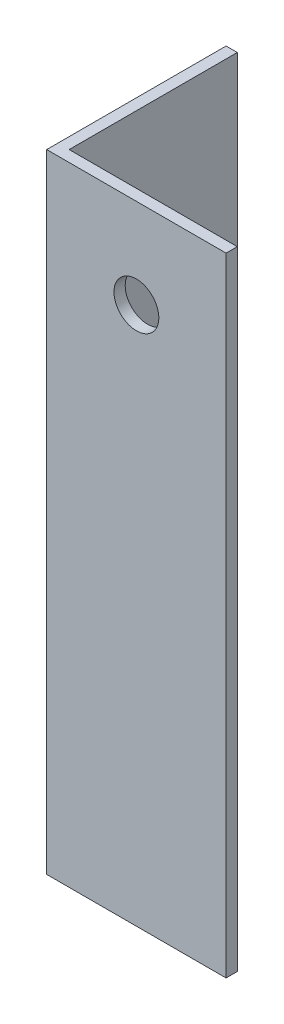
ISO-10303-21;
HEADER;
FILE_DESCRIPTION(('STEP AP214'),'2;1');
FILE_NAME('part.step','',(''),(''),'','','');
FILE_SCHEMA(('AUTOMOTIVE_DESIGN { 1 0 10303 214 1 1 1 1 }'));
ENDSEC;
DATA;
#1=APPLICATION_CONTEXT('core data for automotive mechanical design processes');
#2=APPLICATION_PROTOCOL_DEFINITION('international standard','automotive_design',2000,#1);
#3=PRODUCT_CONTEXT('',#1,'mechanical');
#4=PRODUCT('Part','Part','',(#3));
#5=PRODUCT_RELATED_PRODUCT_CATEGORY('part','',(#4));
#6=PRODUCT_DEFINITION_FORMATION('','',#4);
#7=PRODUCT_DEFINITION_CONTEXT('part definition',#1,'design');
#8=PRODUCT_DEFINITION('design','',#6,#7);
#9=PRODUCT_DEFINITION_SHAPE('','',#8);
#10=(LENGTH_UNIT() NAMED_UNIT(*) SI_UNIT(.MILLI.,.METRE.));
#11=(NAMED_UNIT(*) PLANE_ANGLE_UNIT() SI_UNIT($,.RADIAN.));
#12=(NAMED_UNIT(*) SI_UNIT($,.STERADIAN.) SOLID_ANGLE_UNIT());
#13=UNCERTAINTY_MEASURE_WITH_UNIT(LENGTH_MEASURE(1.E-05),#10,'distance_accuracy_value','');
#14=(GEOMETRIC_REPRESENTATION_CONTEXT(3) GLOBAL_UNCERTAINTY_ASSIGNED_CONTEXT((#13)) GLOBAL_UNIT_ASSIGNED_CONTEXT((#10,
#11,#12)) REPRESENTATION_CONTEXT('',''));
#15=CARTESIAN_POINT('',(0.,0.,0.));
#16=DIRECTION('',(0.,0.,1.));
#17=DIRECTION('',(1.,0.,0.));
#18=AXIS2_PLACEMENT_3D('',#15,#16,#17);
#19=CARTESIAN_POINT('',(25.4,88.9,0.));
#20=DIRECTION('',(0.,0.,-1.));
#21=DIRECTION('',(-1.,0.,0.));
#22=AXIS2_PLACEMENT_3D('',#19,#20,#21);
#23=PLANE('',#22);
#24=CARTESIAN_POINT('',(12.7,76.2,0.));
#25=DIRECTION('',(0.,0.,-1.));
#26=DIRECTION('',(-1.,0.,0.));
#27=AXIS2_PLACEMENT_3D('',#24,#25,#26);
#28=CIRCLE('',#27,3.175);
#29=CARTESIAN_POINT('',(9.525,76.2,0.));
#30=VERTEX_POINT('',#29);
#31=EDGE_CURVE('E163',#30,#30,#28,.T.);
#32=ORIENTED_EDGE('',*,*,#31,.T.);
#33=EDGE_LOOP('',(#32));
#34=FACE_BOUND('',#33,.T.);
#35=DIRECTION('',(1.,0.,0.));
#36=VECTOR('',#35,1.);
#37=CARTESIAN_POINT('',(25.4,0.,0.));
#38=LINE('',#37,#36);
#39=CARTESIAN_POINT('',(0.,0.,0.));
#40=VERTEX_POINT('',#39);
#41=CARTESIAN_POINT('',(25.4,0.,0.));
#42=VERTEX_POINT('',#41);
#43=EDGE_CURVE('E118',#40,#42,#38,.T.);
#44=ORIENTED_EDGE('',*,*,#43,.T.);
#45=DIRECTION('',(0.,-1.,0.));
#46=VECTOR('',#45,1.);
#47=CARTESIAN_POINT('',(25.4,88.9,0.));
#48=LINE('',#47,#46);
#49=CARTESIAN_POINT('',(25.4,88.9,0.));
#50=VERTEX_POINT('',#49);
#51=EDGE_CURVE('E11',#50,#42,#48,.T.);
#52=ORIENTED_EDGE('',*,*,#51,.F.);
#53=DIRECTION('',(1.,0.,0.));
#54=VECTOR('',#53,1.);
#55=CARTESIAN_POINT('',(25.4,88.9,0.));
#56=LINE('',#55,#54);
#57=CARTESIAN_POINT('',(0.,88.9,0.));
#58=VERTEX_POINT('',#57);
#59=EDGE_CURVE('E129',#58,#50,#56,.T.);
#60=ORIENTED_EDGE('',*,*,#59,.F.);
#61=DIRECTION('',(0.,-1.,0.));
#62=VECTOR('',#61,1.);
#63=CARTESIAN_POINT('',(0.,88.9,0.));
#64=LINE('',#63,#62);
#65=EDGE_CURVE('E114',#58,#40,#64,.T.);
#66=ORIENTED_EDGE('',*,*,#65,.T.);
#67=EDGE_LOOP('',(#44,#52,#60,#66));
#68=FACE_BOUND('',#67,.T.);
#69=ADVANCED_FACE('F34',(#34,#68),#23,.F.);
#70=CARTESIAN_POINT('',(25.4,88.9,-1.5875));
#71=DIRECTION('',(-1.,0.,0.));
#72=DIRECTION('',(0.,0.,1.));
#73=AXIS2_PLACEMENT_3D('',#70,#71,#72);
#74=PLANE('',#73);
#75=DIRECTION('',(0.,0.,-1.));
#76=VECTOR('',#75,1.);
#77=CARTESIAN_POINT('',(25.4,0.,-1.5875));
#78=LINE('',#77,#76);
#79=CARTESIAN_POINT('',(25.4,0.,-1.5875));
#80=VERTEX_POINT('',#79);
#81=EDGE_CURVE('E121',#42,#80,#78,.T.);
#82=ORIENTED_EDGE('',*,*,#81,.T.);
#83=DIRECTION('',(0.,-1.,0.));
#84=VECTOR('',#83,1.);
#85=CARTESIAN_POINT('',(25.4,88.9,-1.5875));
#86=LINE('',#85,#84);
#87=CARTESIAN_POINT('',(25.4,88.9,-1.5875));
#88=VERTEX_POINT('',#87);
#89=EDGE_CURVE('E42',#88,#80,#86,.T.);
#90=ORIENTED_EDGE('',*,*,#89,.F.);
#91=DIRECTION('',(0.,0.,-1.));
#92=VECTOR('',#91,1.);
#93=CARTESIAN_POINT('',(25.4,88.9,-1.5875));
#94=LINE('',#93,#92);
#95=EDGE_CURVE('E87',#50,#88,#94,.T.);
#96=ORIENTED_EDGE('',*,*,#95,.F.);
#97=ORIENTED_EDGE('',*,*,#51,.T.);
#98=EDGE_LOOP('',(#82,#90,#96,#97));
#99=FACE_BOUND('',#98,.T.);
#100=ADVANCED_FACE('F156',(#99),#74,.F.);
#101=CARTESIAN_POINT('',(1.5875,88.9,-1.5875));
#102=DIRECTION('',(0.,0.,1.));
#103=DIRECTION('',(1.,0.,0.));
#104=AXIS2_PLACEMENT_3D('',#101,#102,#103);
#105=PLANE('',#104);
#106=CARTESIAN_POINT('',(12.7,76.2,-1.5875));
#107=DIRECTION('',(0.,0.,-1.));
#108=DIRECTION('',(-1.,0.,0.));
#109=AXIS2_PLACEMENT_3D('',#106,#107,#108);
#110=CIRCLE('',#109,3.175);
#111=CARTESIAN_POINT('',(9.525,76.2,-1.5875));
#112=VERTEX_POINT('',#111);
#113=EDGE_CURVE('E166',#112,#112,#110,.T.);
#114=ORIENTED_EDGE('',*,*,#113,.F.);
#115=EDGE_LOOP('',(#114));
#116=FACE_BOUND('',#115,.T.);
#117=DIRECTION('',(-1.,0.,0.));
#118=VECTOR('',#117,1.);
#119=CARTESIAN_POINT('',(1.5875,0.,-1.5875));
#120=LINE('',#119,#118);
#121=CARTESIAN_POINT('',(1.5875,0.,-1.5875));
#122=VERTEX_POINT('',#121);
#123=EDGE_CURVE('E124',#80,#122,#120,.T.);
#124=ORIENTED_EDGE('',*,*,#123,.T.);
#125=DIRECTION('',(0.,-1.,0.));
#126=VECTOR('',#125,1.);
#127=CARTESIAN_POINT('',(1.5875,88.9,-1.5875));
#128=LINE('',#127,#126);
#129=CARTESIAN_POINT('',(1.5875,88.9,-1.5875));
#130=VERTEX_POINT('',#129);
#131=EDGE_CURVE('E109',#130,#122,#128,.T.);
#132=ORIENTED_EDGE('',*,*,#131,.F.);
#133=DIRECTION('',(-1.,0.,0.));
#134=VECTOR('',#133,1.);
#135=CARTESIAN_POINT('',(1.5875,88.9,-1.5875));
#136=LINE('',#135,#134);
#137=EDGE_CURVE('E100',#88,#130,#136,.T.);
#138=ORIENTED_EDGE('',*,*,#137,.F.);
#139=ORIENTED_EDGE('',*,*,#89,.T.);
#140=EDGE_LOOP('',(#124,#132,#138,#139));
#141=FACE_BOUND('',#140,.T.);
#142=ADVANCED_FACE('F135',(#116,#141),#105,.F.);
#143=CARTESIAN_POINT('',(1.5875,88.9,-25.4));
#144=DIRECTION('',(-1.,0.,0.));
#145=DIRECTION('',(0.,0.,1.));
#146=AXIS2_PLACEMENT_3D('',#143,#144,#145);
#147=PLANE('',#146);
#148=CARTESIAN_POINT('',(1.58750000000001,12.7,-12.7));
#149=DIRECTION('',(-1.,0.,0.));
#150=DIRECTION('',(0.,0.,1.));
#151=AXIS2_PLACEMENT_3D('',#148,#149,#150);
#152=CIRCLE('',#151,2.54);
#153=CARTESIAN_POINT('',(1.58750000000001,12.7,-10.16));
#154=VERTEX_POINT('',#153);
#155=EDGE_CURVE('E169',#154,#154,#152,.T.);
#156=ORIENTED_EDGE('',*,*,#155,.T.);
#157=EDGE_LOOP('',(#156));
#158=FACE_BOUND('',#157,.T.);
#159=CARTESIAN_POINT('',(1.58750000000001,38.1,-12.7));
#160=DIRECTION('',(-1.,0.,0.));
#161=DIRECTION('',(0.,0.,1.));
#162=AXIS2_PLACEMENT_3D('',#159,#160,#161);
#163=CIRCLE('',#162,2.54);
#164=CARTESIAN_POINT('',(1.58750000000001,38.1,-10.16));
#165=VERTEX_POINT('',#164);
#166=EDGE_CURVE('E122',#165,#165,#163,.T.);
#167=ORIENTED_EDGE('',*,*,#166,.T.);
#168=EDGE_LOOP('',(#167));
#169=FACE_BOUND('',#168,.T.);
#170=DIRECTION('',(0.,0.,-1.));
#171=VECTOR('',#170,1.);
#172=CARTESIAN_POINT('',(1.5875,0.,-25.4));
#173=LINE('',#172,#171);
#174=CARTESIAN_POINT('',(1.5875,0.,-25.4));
#175=VERTEX_POINT('',#174);
#176=EDGE_CURVE('E108',#122,#175,#173,.T.);
#177=ORIENTED_EDGE('',*,*,#176,.T.);
#178=DIRECTION('',(0.,-1.,0.));
#179=VECTOR('',#178,1.);
#180=CARTESIAN_POINT('',(1.5875,88.9,-25.4));
#181=LINE('',#180,#179);
#182=CARTESIAN_POINT('',(1.5875,88.9,-25.4));
#183=VERTEX_POINT('',#182);
#184=EDGE_CURVE('E105',#183,#175,#181,.T.);
#185=ORIENTED_EDGE('',*,*,#184,.F.);
#186=DIRECTION('',(0.,0.,-1.));
#187=VECTOR('',#186,1.);
#188=CARTESIAN_POINT('',(1.5875,88.9,-25.4));
#189=LINE('',#188,#187);
#190=EDGE_CURVE('E94',#130,#183,#189,.T.);
#191=ORIENTED_EDGE('',*,*,#190,.F.);
#192=ORIENTED_EDGE('',*,*,#131,.T.);
#193=EDGE_LOOP('',(#177,#185,#191,#192));
#194=FACE_BOUND('',#193,.T.);
#195=ADVANCED_FACE('F106',(#158,#169,#194),#147,.F.);
#196=CARTESIAN_POINT('',(0.,88.9,-25.4));
#197=DIRECTION('',(0.,0.,1.));
#198=DIRECTION('',(1.,0.,0.));
#199=AXIS2_PLACEMENT_3D('',#196,#197,#198);
#200=PLANE('',#199);
#201=DIRECTION('',(-1.,0.,0.));
#202=VECTOR('',#201,1.);
#203=CARTESIAN_POINT('',(0.,0.,-25.4));
#204=LINE('',#203,#202);
#205=CARTESIAN_POINT('',(0.,0.,-25.4));
#206=VERTEX_POINT('',#205);
#207=EDGE_CURVE('E73',#175,#206,#204,.T.);
#208=ORIENTED_EDGE('',*,*,#207,.T.);
#209=DIRECTION('',(0.,-1.,0.));
#210=VECTOR('',#209,1.);
#211=CARTESIAN_POINT('',(0.,88.9,-25.4));
#212=LINE('',#211,#210);
#213=CARTESIAN_POINT('',(0.,88.9,-25.4));
#214=VERTEX_POINT('',#213);
#215=EDGE_CURVE('E110',#214,#206,#212,.T.);
#216=ORIENTED_EDGE('',*,*,#215,.F.);
#217=DIRECTION('',(-1.,0.,0.));
#218=VECTOR('',#217,1.);
#219=CARTESIAN_POINT('',(0.,88.9,-25.4));
#220=LINE('',#219,#218);
#221=EDGE_CURVE('E98',#183,#214,#220,.T.);
#222=ORIENTED_EDGE('',*,*,#221,.F.);
#223=ORIENTED_EDGE('',*,*,#184,.T.);
#224=EDGE_LOOP('',(#208,#216,#222,#223));
#225=FACE_BOUND('',#224,.T.);
#226=ADVANCED_FACE('F112',(#225),#200,.F.);
#227=CARTESIAN_POINT('',(0.,88.9,0.));
#228=DIRECTION('',(1.,0.,0.));
#229=DIRECTION('',(0.,0.,-1.));
#230=AXIS2_PLACEMENT_3D('',#227,#228,#229);
#231=PLANE('',#230);
#232=CARTESIAN_POINT('',(0.,12.7,-12.7));
#233=DIRECTION('',(-1.,0.,0.));
#234=DIRECTION('',(0.,0.,1.));
#235=AXIS2_PLACEMENT_3D('',#232,#233,#234);
#236=CIRCLE('',#235,2.54);
#237=CARTESIAN_POINT('',(0.,12.7,-10.16));
#238=VERTEX_POINT('',#237);
#239=EDGE_CURVE('E165',#238,#238,#236,.T.);
#240=ORIENTED_EDGE('',*,*,#239,.F.);
#241=EDGE_LOOP('',(#240));
#242=FACE_BOUND('',#241,.T.);
#243=CARTESIAN_POINT('',(0.,38.1,-12.7));
#244=DIRECTION('',(-1.,0.,0.));
#245=DIRECTION('',(0.,0.,1.));
#246=AXIS2_PLACEMENT_3D('',#243,#244,#245);
#247=CIRCLE('',#246,2.54);
#248=CARTESIAN_POINT('',(0.,38.1,-10.16));
#249=VERTEX_POINT('',#248);
#250=EDGE_CURVE('E176',#249,#249,#247,.T.);
#251=ORIENTED_EDGE('',*,*,#250,.F.);
#252=EDGE_LOOP('',(#251));
#253=FACE_BOUND('',#252,.T.);
#254=DIRECTION('',(0.,0.,1.));
#255=VECTOR('',#254,1.);
#256=CARTESIAN_POINT('',(0.,0.,0.));
#257=LINE('',#256,#255);
#258=EDGE_CURVE('E79',#206,#40,#257,.T.);
#259=ORIENTED_EDGE('',*,*,#258,.T.);
#260=ORIENTED_EDGE('',*,*,#65,.F.);
#261=DIRECTION('',(0.,0.,1.));
#262=VECTOR('',#261,1.);
#263=CARTESIAN_POINT('',(0.,88.9,0.));
#264=LINE('',#263,#262);
#265=EDGE_CURVE('E50',#214,#58,#264,.T.);
#266=ORIENTED_EDGE('',*,*,#265,.F.);
#267=ORIENTED_EDGE('',*,*,#215,.T.);
#268=EDGE_LOOP('',(#259,#260,#266,#267));
#269=FACE_BOUND('',#268,.T.);
#270=ADVANCED_FACE('F142',(#242,#253,#269),#231,.F.);
#271=CARTESIAN_POINT('',(0.,88.9,0.));
#272=DIRECTION('',(0.,-1.,0.));
#273=DIRECTION('',(0.,0.,-1.));
#274=AXIS2_PLACEMENT_3D('',#271,#272,#273);
#275=PLANE('',#274);
#276=ORIENTED_EDGE('',*,*,#59,.T.);
#277=ORIENTED_EDGE('',*,*,#95,.T.);
#278=ORIENTED_EDGE('',*,*,#137,.T.);
#279=ORIENTED_EDGE('',*,*,#190,.T.);
#280=ORIENTED_EDGE('',*,*,#221,.T.);
#281=ORIENTED_EDGE('',*,*,#265,.T.);
#282=EDGE_LOOP('',(#276,#277,#278,#279,#280,#281));
#283=FACE_BOUND('',#282,.T.);
#284=ADVANCED_FACE('F96',(#283),#275,.F.);
#285=CARTESIAN_POINT('',(0.,0.,0.));
#286=DIRECTION('',(0.,-1.,0.));
#287=DIRECTION('',(0.,0.,-1.));
#288=AXIS2_PLACEMENT_3D('',#285,#286,#287);
#289=PLANE('',#288);
#290=ORIENTED_EDGE('',*,*,#43,.F.);
#291=ORIENTED_EDGE('',*,*,#258,.F.);
#292=ORIENTED_EDGE('',*,*,#207,.F.);
#293=ORIENTED_EDGE('',*,*,#176,.F.);
#294=ORIENTED_EDGE('',*,*,#123,.F.);
#295=ORIENTED_EDGE('',*,*,#81,.F.);
#296=EDGE_LOOP('',(#290,#291,#292,#293,#294,#295));
#297=FACE_BOUND('',#296,.T.);
#298=ADVANCED_FACE('F138',(#297),#289,.T.);
#299=CARTESIAN_POINT('',(88.9,38.1,-12.7));
#300=DIRECTION('',(-1.,0.,0.));
#301=DIRECTION('',(0.,0.,1.));
#302=AXIS2_PLACEMENT_3D('',#299,#300,#301);
#303=CYLINDRICAL_SURFACE('',#302,2.54);
#304=ORIENTED_EDGE('',*,*,#250,.T.);
#305=EDGE_LOOP('',(#304));
#306=FACE_BOUND('',#305,.T.);
#307=ORIENTED_EDGE('',*,*,#166,.F.);
#308=EDGE_LOOP('',(#307));
#309=FACE_BOUND('',#308,.T.);
#310=ADVANCED_FACE('F185',(#306,#309),#303,.F.);
#311=CARTESIAN_POINT('',(88.9,12.7,-12.7));
#312=DIRECTION('',(-1.,0.,0.));
#313=DIRECTION('',(0.,0.,1.));
#314=AXIS2_PLACEMENT_3D('',#311,#312,#313);
#315=CYLINDRICAL_SURFACE('',#314,2.54);
#316=ORIENTED_EDGE('',*,*,#239,.T.);
#317=EDGE_LOOP('',(#316));
#318=FACE_BOUND('',#317,.T.);
#319=ORIENTED_EDGE('',*,*,#155,.F.);
#320=EDGE_LOOP('',(#319));
#321=FACE_BOUND('',#320,.T.);
#322=ADVANCED_FACE('F187',(#318,#321),#315,.F.);
#323=CARTESIAN_POINT('',(12.7,76.2,87.3125));
#324=DIRECTION('',(0.,0.,-1.));
#325=DIRECTION('',(-1.,0.,0.));
#326=AXIS2_PLACEMENT_3D('',#323,#324,#325);
#327=CYLINDRICAL_SURFACE('',#326,3.175);
#328=ORIENTED_EDGE('',*,*,#113,.T.);
#329=EDGE_LOOP('',(#328));
#330=FACE_BOUND('',#329,.T.);
#331=ORIENTED_EDGE('',*,*,#31,.F.);
#332=EDGE_LOOP('',(#331));
#333=FACE_BOUND('',#332,.T.);
#334=ADVANCED_FACE('F194',(#330,#333),#327,.F.);
#335=CLOSED_SHELL('',(#69,#100,#142,#195,#226,#270,#284,#298,#310,#322,#334));
#336=MANIFOLD_SOLID_BREP('B2',#335);
#337=ADVANCED_BREP_SHAPE_REPRESENTATION('',(#18,#336),#14);
#338=SHAPE_DEFINITION_REPRESENTATION(#9,#337);
ENDSEC;
END-ISO-10303-21;
